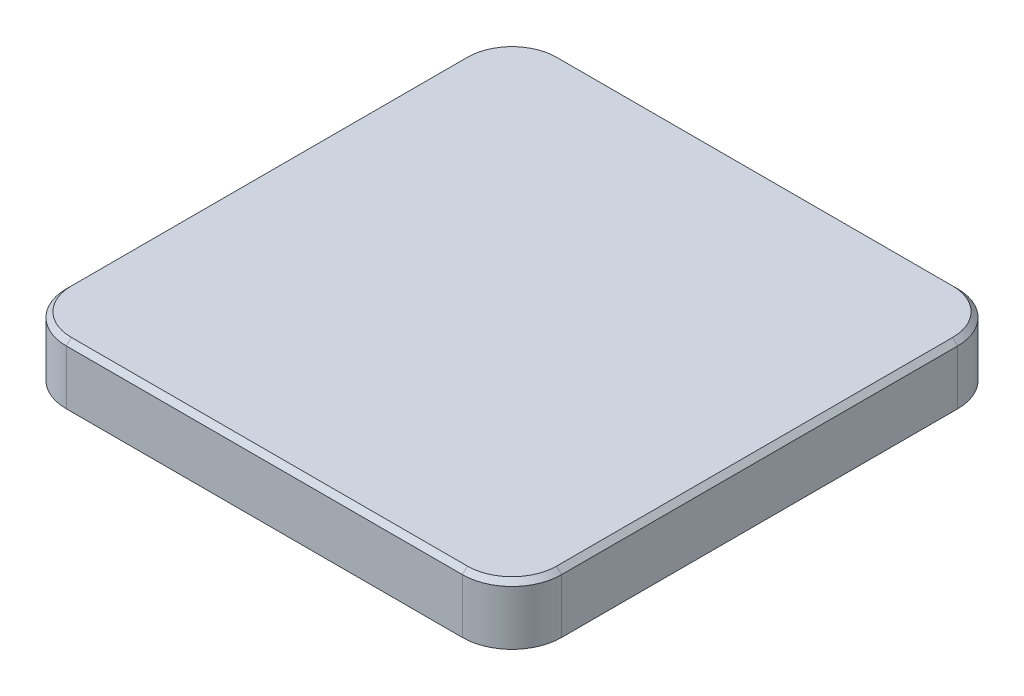
ISO-10303-21;
HEADER;
FILE_DESCRIPTION(('STEP AP214'),'2;1');
FILE_NAME('part.step','',(''),(''),'','','');
FILE_SCHEMA(('AUTOMOTIVE_DESIGN { 1 0 10303 214 1 1 1 1 }'));
ENDSEC;
DATA;
#1=APPLICATION_CONTEXT('core data for automotive mechanical design processes');
#2=APPLICATION_PROTOCOL_DEFINITION('international standard','automotive_design',2000,#1);
#3=PRODUCT_CONTEXT('',#1,'mechanical');
#4=PRODUCT('Part','Part','',(#3));
#5=PRODUCT_RELATED_PRODUCT_CATEGORY('part','',(#4));
#6=PRODUCT_DEFINITION_FORMATION('','',#4);
#7=PRODUCT_DEFINITION_CONTEXT('part definition',#1,'design');
#8=PRODUCT_DEFINITION('design','',#6,#7);
#9=PRODUCT_DEFINITION_SHAPE('','',#8);
#10=(LENGTH_UNIT() NAMED_UNIT(*) SI_UNIT(.MILLI.,.METRE.));
#11=(NAMED_UNIT(*) PLANE_ANGLE_UNIT() SI_UNIT($,.RADIAN.));
#12=(NAMED_UNIT(*) SI_UNIT($,.STERADIAN.) SOLID_ANGLE_UNIT());
#13=UNCERTAINTY_MEASURE_WITH_UNIT(LENGTH_MEASURE(1.E-05),#10,'distance_accuracy_value','');
#14=(GEOMETRIC_REPRESENTATION_CONTEXT(3) GLOBAL_UNCERTAINTY_ASSIGNED_CONTEXT((#13)) GLOBAL_UNIT_ASSIGNED_CONTEXT((#10,
#11,#12)) REPRESENTATION_CONTEXT('',''));
#15=CARTESIAN_POINT('',(0.,0.,0.));
#16=DIRECTION('',(0.,0.,1.));
#17=DIRECTION('',(1.,0.,0.));
#18=AXIS2_PLACEMENT_3D('',#15,#16,#17);
#19=CARTESIAN_POINT('',(-40.,6.,40.));
#20=DIRECTION('',(0.,-1.,0.));
#21=DIRECTION('',(0.,0.,-1.));
#22=AXIS2_PLACEMENT_3D('',#19,#20,#21);
#23=CYLINDRICAL_SURFACE('',#22,10.);
#24=DIRECTION('',(0.,-1.,0.));
#25=VECTOR('',#24,1.);
#26=CARTESIAN_POINT('',(-39.9999999999999,6.,50.));
#27=LINE('',#26,#25);
#28=CARTESIAN_POINT('',(-39.9999999999999,5.,50.));
#29=VERTEX_POINT('',#28);
#30=CARTESIAN_POINT('',(-39.9999999999999,-6.,50.));
#31=VERTEX_POINT('',#30);
#32=EDGE_CURVE('E120',#29,#31,#27,.T.);
#33=ORIENTED_EDGE('',*,*,#32,.F.);
#34=CARTESIAN_POINT('',(-40.,5.,40.));
#35=DIRECTION('',(0.,-1.,0.));
#36=DIRECTION('',(0.,0.,-1.));
#37=AXIS2_PLACEMENT_3D('',#34,#35,#36);
#38=CIRCLE('',#37,10.);
#39=CARTESIAN_POINT('',(-50.,5.,39.9999999999999));
#40=VERTEX_POINT('',#39);
#41=EDGE_CURVE('E201',#29,#40,#38,.T.);
#42=ORIENTED_EDGE('',*,*,#41,.T.);
#43=DIRECTION('',(0.,-1.,0.));
#44=VECTOR('',#43,1.);
#45=CARTESIAN_POINT('',(-50.,6.,39.9999999999999));
#46=LINE('',#45,#44);
#47=CARTESIAN_POINT('',(-50.,-6.,39.9999999999999));
#48=VERTEX_POINT('',#47);
#49=EDGE_CURVE('E141',#40,#48,#46,.T.);
#50=ORIENTED_EDGE('',*,*,#49,.T.);
#51=CARTESIAN_POINT('',(-40.,-6.,40.));
#52=DIRECTION('',(0.,1.,0.));
#53=DIRECTION('',(0.,0.,-1.));
#54=AXIS2_PLACEMENT_3D('',#51,#52,#53);
#55=CIRCLE('',#54,10.);
#56=EDGE_CURVE('E135',#48,#31,#55,.T.);
#57=ORIENTED_EDGE('',*,*,#56,.T.);
#58=EDGE_LOOP('',(#33,#42,#50,#57));
#59=FACE_BOUND('',#58,.T.);
#60=ADVANCED_FACE('F33',(#59),#23,.T.);
#61=CARTESIAN_POINT('',(-39.9999999999999,6.,50.));
#62=DIRECTION('',(0.,0.,-1.));
#63=DIRECTION('',(-1.,0.,0.));
#64=AXIS2_PLACEMENT_3D('',#61,#62,#63);
#65=PLANE('',#64);
#66=DIRECTION('',(0.,-1.,0.));
#67=VECTOR('',#66,1.);
#68=CARTESIAN_POINT('',(39.9999999999999,6.,50.));
#69=LINE('',#68,#67);
#70=CARTESIAN_POINT('',(39.9999999999999,5.,50.));
#71=VERTEX_POINT('',#70);
#72=CARTESIAN_POINT('',(39.9999999999999,-6.,50.));
#73=VERTEX_POINT('',#72);
#74=EDGE_CURVE('E129',#71,#73,#69,.T.);
#75=ORIENTED_EDGE('',*,*,#74,.F.);
#76=DIRECTION('',(-1.,0.,0.));
#77=VECTOR('',#76,1.);
#78=CARTESIAN_POINT('',(-39.9999999999999,5.,50.));
#79=LINE('',#78,#77);
#80=EDGE_CURVE('E11',#71,#29,#79,.T.);
#81=ORIENTED_EDGE('',*,*,#80,.T.);
#82=ORIENTED_EDGE('',*,*,#32,.T.);
#83=DIRECTION('',(1.,0.,0.));
#84=VECTOR('',#83,1.);
#85=CARTESIAN_POINT('',(-39.9999999999999,-6.,50.));
#86=LINE('',#85,#84);
#87=EDGE_CURVE('E123',#31,#73,#86,.T.);
#88=ORIENTED_EDGE('',*,*,#87,.T.);
#89=EDGE_LOOP('',(#75,#81,#82,#88));
#90=FACE_BOUND('',#89,.T.);
#91=ADVANCED_FACE('F122',(#90),#65,.F.);
#92=CARTESIAN_POINT('',(40.,6.,40.));
#93=DIRECTION('',(0.,-1.,0.));
#94=DIRECTION('',(0.,0.,-1.));
#95=AXIS2_PLACEMENT_3D('',#92,#93,#94);
#96=CYLINDRICAL_SURFACE('',#95,10.);
#97=DIRECTION('',(0.,-1.,0.));
#98=VECTOR('',#97,1.);
#99=CARTESIAN_POINT('',(50.,6.,39.9999999999999));
#100=LINE('',#99,#98);
#101=CARTESIAN_POINT('',(50.,5.,39.9999999999999));
#102=VERTEX_POINT('',#101);
#103=CARTESIAN_POINT('',(50.,-6.,39.9999999999999));
#104=VERTEX_POINT('',#103);
#105=EDGE_CURVE('E171',#102,#104,#100,.T.);
#106=ORIENTED_EDGE('',*,*,#105,.F.);
#107=CARTESIAN_POINT('',(40.,5.,40.));
#108=DIRECTION('',(0.,-1.,0.));
#109=DIRECTION('',(0.,0.,-1.));
#110=AXIS2_PLACEMENT_3D('',#107,#108,#109);
#111=CIRCLE('',#110,10.);
#112=EDGE_CURVE('E42',#102,#71,#111,.T.);
#113=ORIENTED_EDGE('',*,*,#112,.T.);
#114=ORIENTED_EDGE('',*,*,#74,.T.);
#115=CARTESIAN_POINT('',(40.,-6.,40.));
#116=DIRECTION('',(0.,1.,0.));
#117=DIRECTION('',(0.,0.,1.));
#118=AXIS2_PLACEMENT_3D('',#115,#116,#117);
#119=CIRCLE('',#118,10.);
#120=EDGE_CURVE('E138',#73,#104,#119,.T.);
#121=ORIENTED_EDGE('',*,*,#120,.T.);
#122=EDGE_LOOP('',(#106,#113,#114,#121));
#123=FACE_BOUND('',#122,.T.);
#124=ADVANCED_FACE('F289',(#123),#96,.T.);
#125=CARTESIAN_POINT('',(50.,6.,39.9999999999999));
#126=DIRECTION('',(-1.,0.,0.));
#127=DIRECTION('',(0.,0.,1.));
#128=AXIS2_PLACEMENT_3D('',#125,#126,#127);
#129=PLANE('',#128);
#130=DIRECTION('',(0.,-1.,0.));
#131=VECTOR('',#130,1.);
#132=CARTESIAN_POINT('',(50.,6.,-39.9999999999999));
#133=LINE('',#132,#131);
#134=CARTESIAN_POINT('',(50.,5.,-39.9999999999999));
#135=VERTEX_POINT('',#134);
#136=CARTESIAN_POINT('',(50.,-6.,-39.9999999999999));
#137=VERTEX_POINT('',#136);
#138=EDGE_CURVE('E169',#135,#137,#133,.T.);
#139=ORIENTED_EDGE('',*,*,#138,.F.);
#140=DIRECTION('',(0.,0.,1.));
#141=VECTOR('',#140,1.);
#142=CARTESIAN_POINT('',(50.,4.99999999999999,39.9999999999999));
#143=LINE('',#142,#141);
#144=EDGE_CURVE('E190',#135,#102,#143,.T.);
#145=ORIENTED_EDGE('',*,*,#144,.T.);
#146=ORIENTED_EDGE('',*,*,#105,.T.);
#147=DIRECTION('',(0.,0.,-1.));
#148=VECTOR('',#147,1.);
#149=CARTESIAN_POINT('',(50.,-6.,39.9999999999999));
#150=LINE('',#149,#148);
#151=EDGE_CURVE('E148',#104,#137,#150,.T.);
#152=ORIENTED_EDGE('',*,*,#151,.T.);
#153=EDGE_LOOP('',(#139,#145,#146,#152));
#154=FACE_BOUND('',#153,.T.);
#155=ADVANCED_FACE('F250',(#154),#129,.F.);
#156=CARTESIAN_POINT('',(40.,6.,-40.));
#157=DIRECTION('',(0.,-1.,0.));
#158=DIRECTION('',(0.,0.,-1.));
#159=AXIS2_PLACEMENT_3D('',#156,#157,#158);
#160=CYLINDRICAL_SURFACE('',#159,10.);
#161=DIRECTION('',(0.,-1.,0.));
#162=VECTOR('',#161,1.);
#163=CARTESIAN_POINT('',(39.9999999999999,6.,-50.));
#164=LINE('',#163,#162);
#165=CARTESIAN_POINT('',(39.9999999999999,5.,-50.));
#166=VERTEX_POINT('',#165);
#167=CARTESIAN_POINT('',(39.9999999999999,-6.,-50.));
#168=VERTEX_POINT('',#167);
#169=EDGE_CURVE('E167',#166,#168,#164,.T.);
#170=ORIENTED_EDGE('',*,*,#169,.F.);
#171=CARTESIAN_POINT('',(40.,5.,-40.));
#172=DIRECTION('',(0.,-1.,0.));
#173=DIRECTION('',(0.,0.,-1.));
#174=AXIS2_PLACEMENT_3D('',#171,#172,#173);
#175=CIRCLE('',#174,10.);
#176=EDGE_CURVE('E197',#166,#135,#175,.T.);
#177=ORIENTED_EDGE('',*,*,#176,.T.);
#178=ORIENTED_EDGE('',*,*,#138,.T.);
#179=CARTESIAN_POINT('',(40.,-6.,-40.));
#180=DIRECTION('',(0.,1.,0.));
#181=DIRECTION('',(0.,0.,1.));
#182=AXIS2_PLACEMENT_3D('',#179,#180,#181);
#183=CIRCLE('',#182,10.);
#184=EDGE_CURVE('E151',#137,#168,#183,.T.);
#185=ORIENTED_EDGE('',*,*,#184,.T.);
#186=EDGE_LOOP('',(#170,#177,#178,#185));
#187=FACE_BOUND('',#186,.T.);
#188=ADVANCED_FACE('F247',(#187),#160,.T.);
#189=CARTESIAN_POINT('',(-39.9999999999999,6.,-50.));
#190=DIRECTION('',(0.,0.,1.));
#191=DIRECTION('',(1.,0.,0.));
#192=AXIS2_PLACEMENT_3D('',#189,#190,#191);
#193=PLANE('',#192);
#194=DIRECTION('',(0.,-1.,0.));
#195=VECTOR('',#194,1.);
#196=CARTESIAN_POINT('',(-39.9999999999999,6.,-50.));
#197=LINE('',#196,#195);
#198=CARTESIAN_POINT('',(-39.9999999999999,5.,-50.));
#199=VERTEX_POINT('',#198);
#200=CARTESIAN_POINT('',(-39.9999999999999,-6.,-50.));
#201=VERTEX_POINT('',#200);
#202=EDGE_CURVE('E165',#199,#201,#197,.T.);
#203=ORIENTED_EDGE('',*,*,#202,.F.);
#204=DIRECTION('',(1.,0.,0.));
#205=VECTOR('',#204,1.);
#206=CARTESIAN_POINT('',(-39.9999999999999,5.,-50.));
#207=LINE('',#206,#205);
#208=EDGE_CURVE('E193',#199,#166,#207,.T.);
#209=ORIENTED_EDGE('',*,*,#208,.T.);
#210=ORIENTED_EDGE('',*,*,#169,.T.);
#211=DIRECTION('',(-1.,0.,0.));
#212=VECTOR('',#211,1.);
#213=CARTESIAN_POINT('',(-39.9999999999999,-6.,-50.));
#214=LINE('',#213,#212);
#215=EDGE_CURVE('E154',#168,#201,#214,.T.);
#216=ORIENTED_EDGE('',*,*,#215,.T.);
#217=EDGE_LOOP('',(#203,#209,#210,#216));
#218=FACE_BOUND('',#217,.T.);
#219=ADVANCED_FACE('F274',(#218),#193,.F.);
#220=CARTESIAN_POINT('',(-40.,6.,-40.));
#221=DIRECTION('',(0.,-1.,0.));
#222=DIRECTION('',(0.,0.,-1.));
#223=AXIS2_PLACEMENT_3D('',#220,#221,#222);
#224=CYLINDRICAL_SURFACE('',#223,10.);
#225=DIRECTION('',(0.,-1.,0.));
#226=VECTOR('',#225,1.);
#227=CARTESIAN_POINT('',(-50.,6.,-39.9999999999999));
#228=LINE('',#227,#226);
#229=CARTESIAN_POINT('',(-50.,5.,-39.9999999999999));
#230=VERTEX_POINT('',#229);
#231=CARTESIAN_POINT('',(-50.,-6.,-39.9999999999999));
#232=VERTEX_POINT('',#231);
#233=EDGE_CURVE('E163',#230,#232,#228,.T.);
#234=ORIENTED_EDGE('',*,*,#233,.F.);
#235=CARTESIAN_POINT('',(-40.,5.,-40.));
#236=DIRECTION('',(0.,-1.,0.));
#237=DIRECTION('',(0.,0.,-1.));
#238=AXIS2_PLACEMENT_3D('',#235,#236,#237);
#239=CIRCLE('',#238,10.);
#240=EDGE_CURVE('E195',#230,#199,#239,.T.);
#241=ORIENTED_EDGE('',*,*,#240,.T.);
#242=ORIENTED_EDGE('',*,*,#202,.T.);
#243=CARTESIAN_POINT('',(-40.,-6.,-40.));
#244=DIRECTION('',(0.,1.,0.));
#245=DIRECTION('',(0.,0.,1.));
#246=AXIS2_PLACEMENT_3D('',#243,#244,#245);
#247=CIRCLE('',#246,10.);
#248=EDGE_CURVE('E157',#201,#232,#247,.T.);
#249=ORIENTED_EDGE('',*,*,#248,.T.);
#250=EDGE_LOOP('',(#234,#241,#242,#249));
#251=FACE_BOUND('',#250,.T.);
#252=ADVANCED_FACE('F271',(#251),#224,.T.);
#253=CARTESIAN_POINT('',(-50.,6.,39.9999999999999));
#254=DIRECTION('',(1.,0.,0.));
#255=DIRECTION('',(0.,0.,-1.));
#256=AXIS2_PLACEMENT_3D('',#253,#254,#255);
#257=PLANE('',#256);
#258=ORIENTED_EDGE('',*,*,#49,.F.);
#259=DIRECTION('',(0.,0.,-1.));
#260=VECTOR('',#259,1.);
#261=CARTESIAN_POINT('',(-50.,5.,39.9999999999999));
#262=LINE('',#261,#260);
#263=EDGE_CURVE('E199',#40,#230,#262,.T.);
#264=ORIENTED_EDGE('',*,*,#263,.T.);
#265=ORIENTED_EDGE('',*,*,#233,.T.);
#266=DIRECTION('',(0.,0.,1.));
#267=VECTOR('',#266,1.);
#268=CARTESIAN_POINT('',(-50.,-6.,39.9999999999999));
#269=LINE('',#268,#267);
#270=EDGE_CURVE('E160',#232,#48,#269,.T.);
#271=ORIENTED_EDGE('',*,*,#270,.T.);
#272=EDGE_LOOP('',(#258,#264,#265,#271));
#273=FACE_BOUND('',#272,.T.);
#274=ADVANCED_FACE('F266',(#273),#257,.F.);
#275=CARTESIAN_POINT('',(-40.,6.,40.));
#276=DIRECTION('',(0.,-1.,0.));
#277=DIRECTION('',(0.,0.,-1.));
#278=AXIS2_PLACEMENT_3D('',#275,#276,#277);
#279=PLANE('',#278);
#280=DIRECTION('',(0.,0.,-1.));
#281=VECTOR('',#280,1.);
#282=CARTESIAN_POINT('',(49.,6.,40.));
#283=LINE('',#282,#281);
#284=CARTESIAN_POINT('',(49.,6.,39.9999999999999));
#285=VERTEX_POINT('',#284);
#286=CARTESIAN_POINT('',(49.,6.,-39.9999999999999));
#287=VERTEX_POINT('',#286);
#288=EDGE_CURVE('E185',#285,#287,#283,.T.);
#289=ORIENTED_EDGE('',*,*,#288,.T.);
#290=CARTESIAN_POINT('',(40.,6.,-40.));
#291=DIRECTION('',(0.,-1.,0.));
#292=DIRECTION('',(0.,0.,-1.));
#293=AXIS2_PLACEMENT_3D('',#290,#291,#292);
#294=CIRCLE('',#293,9.);
#295=CARTESIAN_POINT('',(39.9999999999999,6.,-49.));
#296=VERTEX_POINT('',#295);
#297=EDGE_CURVE('E188',#287,#296,#294,.F.);
#298=ORIENTED_EDGE('',*,*,#297,.T.);
#299=DIRECTION('',(-1.,0.,0.));
#300=VECTOR('',#299,1.);
#301=CARTESIAN_POINT('',(-40.,6.,-49.));
#302=LINE('',#301,#300);
#303=CARTESIAN_POINT('',(-39.9999999999999,6.,-49.));
#304=VERTEX_POINT('',#303);
#305=EDGE_CURVE('E183',#296,#304,#302,.T.);
#306=ORIENTED_EDGE('',*,*,#305,.T.);
#307=CARTESIAN_POINT('',(-40.,6.,-40.));
#308=DIRECTION('',(0.,-1.,0.));
#309=DIRECTION('',(0.,0.,-1.));
#310=AXIS2_PLACEMENT_3D('',#307,#308,#309);
#311=CIRCLE('',#310,9.);
#312=CARTESIAN_POINT('',(-49.,6.,-39.9999999999999));
#313=VERTEX_POINT('',#312);
#314=EDGE_CURVE('E181',#304,#313,#311,.F.);
#315=ORIENTED_EDGE('',*,*,#314,.T.);
#316=DIRECTION('',(0.,0.,1.));
#317=VECTOR('',#316,1.);
#318=CARTESIAN_POINT('',(-49.,6.,40.));
#319=LINE('',#318,#317);
#320=CARTESIAN_POINT('',(-49.,6.,39.9999999999999));
#321=VERTEX_POINT('',#320);
#322=EDGE_CURVE('E179',#313,#321,#319,.T.);
#323=ORIENTED_EDGE('',*,*,#322,.T.);
#324=CARTESIAN_POINT('',(-40.,6.,40.));
#325=DIRECTION('',(0.,-1.,0.));
#326=DIRECTION('',(0.,0.,-1.));
#327=AXIS2_PLACEMENT_3D('',#324,#325,#326);
#328=CIRCLE('',#327,9.);
#329=CARTESIAN_POINT('',(-39.9999999999999,6.,49.));
#330=VERTEX_POINT('',#329);
#331=EDGE_CURVE('E177',#321,#330,#328,.F.);
#332=ORIENTED_EDGE('',*,*,#331,.T.);
#333=DIRECTION('',(1.,0.,0.));
#334=VECTOR('',#333,1.);
#335=CARTESIAN_POINT('',(-40.,6.,49.));
#336=LINE('',#335,#334);
#337=CARTESIAN_POINT('',(39.9999999999999,6.,49.));
#338=VERTEX_POINT('',#337);
#339=EDGE_CURVE('E128',#330,#338,#336,.T.);
#340=ORIENTED_EDGE('',*,*,#339,.T.);
#341=CARTESIAN_POINT('',(40.,6.,40.));
#342=DIRECTION('',(0.,-1.,0.));
#343=DIRECTION('',(0.,0.,-1.));
#344=AXIS2_PLACEMENT_3D('',#341,#342,#343);
#345=CIRCLE('',#344,9.);
#346=EDGE_CURVE('E175',#338,#285,#345,.F.);
#347=ORIENTED_EDGE('',*,*,#346,.T.);
#348=EDGE_LOOP('',(#289,#298,#306,#315,#323,#332,#340,#347));
#349=FACE_BOUND('',#348,.T.);
#350=ADVANCED_FACE('F232',(#349),#279,.F.);
#351=CARTESIAN_POINT('',(-40.,-6.,40.));
#352=DIRECTION('',(0.,-1.,0.));
#353=DIRECTION('',(0.,0.,-1.));
#354=AXIS2_PLACEMENT_3D('',#351,#352,#353);
#355=PLANE('',#354);
#356=ORIENTED_EDGE('',*,*,#56,.F.);
#357=ORIENTED_EDGE('',*,*,#270,.F.);
#358=ORIENTED_EDGE('',*,*,#248,.F.);
#359=ORIENTED_EDGE('',*,*,#215,.F.);
#360=ORIENTED_EDGE('',*,*,#184,.F.);
#361=ORIENTED_EDGE('',*,*,#151,.F.);
#362=ORIENTED_EDGE('',*,*,#120,.F.);
#363=ORIENTED_EDGE('',*,*,#87,.F.);
#364=EDGE_LOOP('',(#356,#357,#358,#359,#360,#361,#362,#363));
#365=FACE_BOUND('',#364,.T.);
#366=ADVANCED_FACE('F133',(#365),#355,.T.);
#367=CARTESIAN_POINT('',(-49.,6.,40.));
#368=DIRECTION('',(0.707106781186547,-0.707106781186547,0.));
#369=DIRECTION('',(0.,0.,1.));
#370=AXIS2_PLACEMENT_3D('',#367,#368,#369);
#371=PLANE('',#370);
#372=DIRECTION('',(0.707106781186547,0.707106781186547,0.));
#373=VECTOR('',#372,1.);
#374=CARTESIAN_POINT('',(-50.,5.,-39.9999999999999));
#375=LINE('',#374,#373);
#376=EDGE_CURVE('E145',#230,#313,#375,.T.);
#377=ORIENTED_EDGE('',*,*,#376,.F.);
#378=ORIENTED_EDGE('',*,*,#263,.F.);
#379=DIRECTION('',(-0.707106781186547,-0.707106781186547,0.));
#380=VECTOR('',#379,1.);
#381=CARTESIAN_POINT('',(-49.,6.,39.9999999999999));
#382=LINE('',#381,#380);
#383=EDGE_CURVE('E37',#321,#40,#382,.T.);
#384=ORIENTED_EDGE('',*,*,#383,.F.);
#385=ORIENTED_EDGE('',*,*,#322,.F.);
#386=EDGE_LOOP('',(#377,#378,#384,#385));
#387=FACE_BOUND('',#386,.T.);
#388=ADVANCED_FACE('F35',(#387),#371,.F.);
#389=CARTESIAN_POINT('',(-40.,6.,40.));
#390=DIRECTION('',(0.,-1.,0.));
#391=DIRECTION('',(0.,0.,-1.));
#392=AXIS2_PLACEMENT_3D('',#389,#390,#391);
#393=CONICAL_SURFACE('',#392,9.,0.785398163397448);
#394=ORIENTED_EDGE('',*,*,#383,.T.);
#395=ORIENTED_EDGE('',*,*,#41,.F.);
#396=DIRECTION('',(0.,-0.707106781186547,0.707106781186547));
#397=VECTOR('',#396,1.);
#398=CARTESIAN_POINT('',(-39.9999999999999,6.,49.));
#399=LINE('',#398,#397);
#400=EDGE_CURVE('E217',#330,#29,#399,.T.);
#401=ORIENTED_EDGE('',*,*,#400,.F.);
#402=ORIENTED_EDGE('',*,*,#331,.F.);
#403=EDGE_LOOP('',(#394,#395,#401,#402));
#404=FACE_BOUND('',#403,.T.);
#405=ADVANCED_FACE('F264',(#404),#393,.T.);
#406=CARTESIAN_POINT('',(-40.,6.,-40.));
#407=DIRECTION('',(0.,-1.,0.));
#408=DIRECTION('',(0.,0.,-1.));
#409=AXIS2_PLACEMENT_3D('',#406,#407,#408);
#410=CONICAL_SURFACE('',#409,9.,0.785398163397448);
#411=ORIENTED_EDGE('',*,*,#376,.T.);
#412=ORIENTED_EDGE('',*,*,#314,.F.);
#413=DIRECTION('',(0.,0.707106781186547,0.707106781186547));
#414=VECTOR('',#413,1.);
#415=CARTESIAN_POINT('',(-39.9999999999999,5.,-50.));
#416=LINE('',#415,#414);
#417=EDGE_CURVE('E214',#199,#304,#416,.T.);
#418=ORIENTED_EDGE('',*,*,#417,.F.);
#419=ORIENTED_EDGE('',*,*,#240,.F.);
#420=EDGE_LOOP('',(#411,#412,#418,#419));
#421=FACE_BOUND('',#420,.T.);
#422=ADVANCED_FACE('F224',(#421),#410,.T.);
#423=CARTESIAN_POINT('',(-40.,6.,49.));
#424=DIRECTION('',(0.,-0.707106781186547,-0.707106781186547));
#425=DIRECTION('',(1.,0.,0.));
#426=AXIS2_PLACEMENT_3D('',#423,#424,#425);
#427=PLANE('',#426);
#428=ORIENTED_EDGE('',*,*,#400,.T.);
#429=ORIENTED_EDGE('',*,*,#80,.F.);
#430=DIRECTION('',(0.,-0.707106781186547,0.707106781186547));
#431=VECTOR('',#430,1.);
#432=CARTESIAN_POINT('',(39.9999999999999,6.,49.));
#433=LINE('',#432,#431);
#434=EDGE_CURVE('E211',#338,#71,#433,.T.);
#435=ORIENTED_EDGE('',*,*,#434,.F.);
#436=ORIENTED_EDGE('',*,*,#339,.F.);
#437=EDGE_LOOP('',(#428,#429,#435,#436));
#438=FACE_BOUND('',#437,.T.);
#439=ADVANCED_FACE('F262',(#438),#427,.F.);
#440=CARTESIAN_POINT('',(-40.,6.,-49.));
#441=DIRECTION('',(0.,-0.70710678118655,0.707106781186545));
#442=DIRECTION('',(-1.,0.,0.));
#443=AXIS2_PLACEMENT_3D('',#440,#441,#442);
#444=PLANE('',#443);
#445=ORIENTED_EDGE('',*,*,#417,.T.);
#446=ORIENTED_EDGE('',*,*,#305,.F.);
#447=DIRECTION('',(0.,0.707106781186545,0.70710678118655));
#448=VECTOR('',#447,1.);
#449=CARTESIAN_POINT('',(39.9999999999999,5.,-50.));
#450=LINE('',#449,#448);
#451=EDGE_CURVE('E208',#166,#296,#450,.T.);
#452=ORIENTED_EDGE('',*,*,#451,.F.);
#453=ORIENTED_EDGE('',*,*,#208,.F.);
#454=EDGE_LOOP('',(#445,#446,#452,#453));
#455=FACE_BOUND('',#454,.T.);
#456=ADVANCED_FACE('F238',(#455),#444,.F.);
#457=CARTESIAN_POINT('',(40.,6.,40.));
#458=DIRECTION('',(0.,-1.,0.));
#459=DIRECTION('',(0.,0.,-1.));
#460=AXIS2_PLACEMENT_3D('',#457,#458,#459);
#461=CONICAL_SURFACE('',#460,9.,0.785398163397448);
#462=ORIENTED_EDGE('',*,*,#434,.T.);
#463=ORIENTED_EDGE('',*,*,#112,.F.);
#464=DIRECTION('',(0.707106781186547,-0.707106781186547,0.));
#465=VECTOR('',#464,1.);
#466=CARTESIAN_POINT('',(49.,6.,39.9999999999999));
#467=LINE('',#466,#465);
#468=EDGE_CURVE('E206',#285,#102,#467,.T.);
#469=ORIENTED_EDGE('',*,*,#468,.F.);
#470=ORIENTED_EDGE('',*,*,#346,.F.);
#471=EDGE_LOOP('',(#462,#463,#469,#470));
#472=FACE_BOUND('',#471,.T.);
#473=ADVANCED_FACE('F258',(#472),#461,.T.);
#474=CARTESIAN_POINT('',(40.,6.,-40.));
#475=DIRECTION('',(0.,-1.,0.));
#476=DIRECTION('',(0.,0.,-1.));
#477=AXIS2_PLACEMENT_3D('',#474,#475,#476);
#478=CONICAL_SURFACE('',#477,9.,0.785398163397448);
#479=ORIENTED_EDGE('',*,*,#451,.T.);
#480=ORIENTED_EDGE('',*,*,#297,.F.);
#481=DIRECTION('',(-0.707106781186547,0.707106781186547,0.));
#482=VECTOR('',#481,1.);
#483=CARTESIAN_POINT('',(50.,5.,-39.9999999999999));
#484=LINE('',#483,#482);
#485=EDGE_CURVE('E204',#135,#287,#484,.T.);
#486=ORIENTED_EDGE('',*,*,#485,.F.);
#487=ORIENTED_EDGE('',*,*,#176,.F.);
#488=EDGE_LOOP('',(#479,#480,#486,#487));
#489=FACE_BOUND('',#488,.T.);
#490=ADVANCED_FACE('F242',(#489),#478,.T.);
#491=CARTESIAN_POINT('',(49.,6.,40.));
#492=DIRECTION('',(-0.707106781186545,-0.70710678118655,0.));
#493=DIRECTION('',(0.,0.,-1.));
#494=AXIS2_PLACEMENT_3D('',#491,#492,#493);
#495=PLANE('',#494);
#496=ORIENTED_EDGE('',*,*,#468,.T.);
#497=ORIENTED_EDGE('',*,*,#144,.F.);
#498=ORIENTED_EDGE('',*,*,#485,.T.);
#499=ORIENTED_EDGE('',*,*,#288,.F.);
#500=EDGE_LOOP('',(#496,#497,#498,#499));
#501=FACE_BOUND('',#500,.T.);
#502=ADVANCED_FACE('F253',(#501),#495,.F.);
#503=CLOSED_SHELL('',(#60,#91,#124,#155,#188,#219,#252,#274,#350,#366,#388,#405,#422,#439,#456,
#473,#490,#502));
#504=MANIFOLD_SOLID_BREP('B2',#503);
#505=ADVANCED_BREP_SHAPE_REPRESENTATION('',(#18,#504),#14);
#506=SHAPE_DEFINITION_REPRESENTATION(#9,#505);
ENDSEC;
END-ISO-10303-21;
